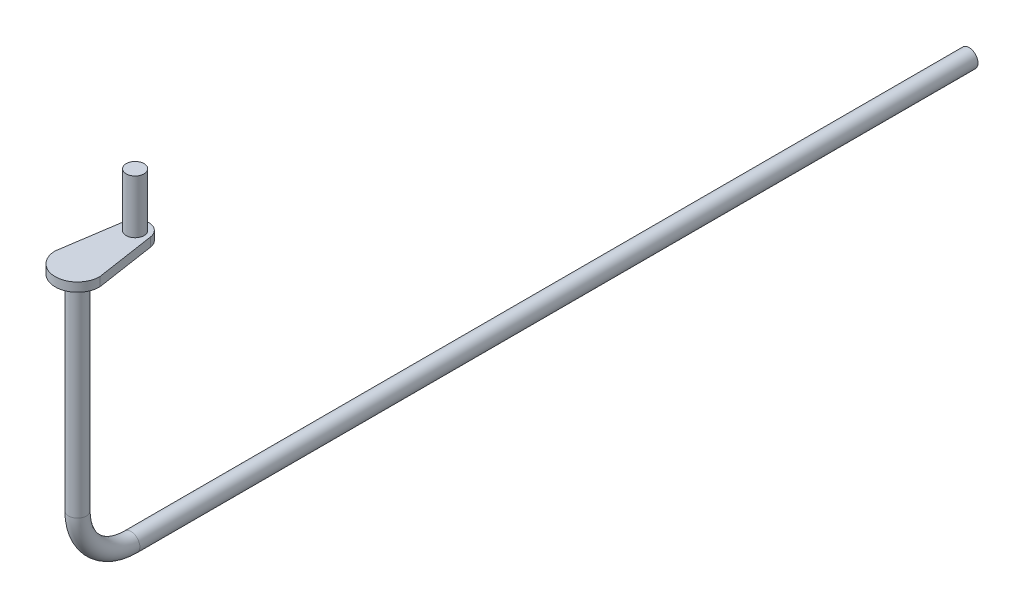
ISO-10303-21;
HEADER;
FILE_DESCRIPTION(('STEP AP214'),'2;1');
FILE_NAME('part.step','',(''),(''),'','','');
FILE_SCHEMA(('AUTOMOTIVE_DESIGN { 1 0 10303 214 1 1 1 1 }'));
ENDSEC;
DATA;
#1=APPLICATION_CONTEXT('core data for automotive mechanical design processes');
#2=APPLICATION_PROTOCOL_DEFINITION('international standard','automotive_design',2000,#1);
#3=PRODUCT_CONTEXT('',#1,'mechanical');
#4=PRODUCT('Part','Part','',(#3));
#5=PRODUCT_RELATED_PRODUCT_CATEGORY('part','',(#4));
#6=PRODUCT_DEFINITION_FORMATION('','',#4);
#7=PRODUCT_DEFINITION_CONTEXT('part definition',#1,'design');
#8=PRODUCT_DEFINITION('design','',#6,#7);
#9=PRODUCT_DEFINITION_SHAPE('','',#8);
#10=(LENGTH_UNIT() NAMED_UNIT(*) SI_UNIT(.MILLI.,.METRE.));
#11=(NAMED_UNIT(*) PLANE_ANGLE_UNIT() SI_UNIT($,.RADIAN.));
#12=(NAMED_UNIT(*) SI_UNIT($,.STERADIAN.) SOLID_ANGLE_UNIT());
#13=UNCERTAINTY_MEASURE_WITH_UNIT(LENGTH_MEASURE(1.E-05),#10,'distance_accuracy_value','');
#14=(GEOMETRIC_REPRESENTATION_CONTEXT(3) GLOBAL_UNCERTAINTY_ASSIGNED_CONTEXT((#13)) GLOBAL_UNIT_ASSIGNED_CONTEXT((#10,
#11,#12)) REPRESENTATION_CONTEXT('',''));
#15=CARTESIAN_POINT('',(0.,0.,0.));
#16=DIRECTION('',(0.,0.,1.));
#17=DIRECTION('',(1.,0.,0.));
#18=AXIS2_PLACEMENT_3D('',#15,#16,#17);
#19=CARTESIAN_POINT('',(24.4410760298696,10.,-3.69603885922141));
#20=DIRECTION('',(0.988758333059592,0.,-0.14952243579215));
#21=DIRECTION('',(-0.14952243579215,0.,-0.988758333059592));
#22=AXIS2_PLACEMENT_3D('',#19,#20,#21);
#23=PLANE('',#22);
#24=DIRECTION('',(0.149522435792151,0.,0.988758333059592));
#25=VECTOR('',#24,1.);
#26=CARTESIAN_POINT('',(24.4410760298696,0.,-3.69603885922141));
#27=LINE('',#26,#25);
#28=CARTESIAN_POINT('',(14.8313749958939,0.,-67.2428365368823));
#29=VERTEX_POINT('',#28);
#30=CARTESIAN_POINT('',(25.,0.,0.));
#31=VERTEX_POINT('',#30);
#32=EDGE_CURVE('E107',#29,#31,#27,.T.);
#33=ORIENTED_EDGE('',*,*,#32,.F.);
#34=DIRECTION('',(0.,-1.,0.));
#35=VECTOR('',#34,1.);
#36=CARTESIAN_POINT('',(14.8313749958939,10.,-67.2428365368823));
#37=LINE('',#36,#35);
#38=CARTESIAN_POINT('',(14.8313749958939,10.,-67.2428365368823));
#39=VERTEX_POINT('',#38);
#40=EDGE_CURVE('E12',#39,#29,#37,.T.);
#41=ORIENTED_EDGE('',*,*,#40,.F.);
#42=DIRECTION('',(0.149522435792151,0.,0.988758333059592));
#43=VECTOR('',#42,1.);
#44=CARTESIAN_POINT('',(24.4410760298696,10.,-3.69603885922141));
#45=LINE('',#44,#43);
#46=CARTESIAN_POINT('',(25.,10.,0.));
#47=VERTEX_POINT('',#46);
#48=EDGE_CURVE('E110',#39,#47,#45,.T.);
#49=ORIENTED_EDGE('',*,*,#48,.T.);
#50=DIRECTION('',(0.,-1.,0.));
#51=VECTOR('',#50,1.);
#52=CARTESIAN_POINT('',(25.,10.,0.));
#53=LINE('',#52,#51);
#54=EDGE_CURVE('E80',#47,#31,#53,.T.);
#55=ORIENTED_EDGE('',*,*,#54,.T.);
#56=EDGE_LOOP('',(#33,#41,#49,#55));
#57=FACE_BOUND('',#56,.T.);
#58=ADVANCED_FACE('F41',(#57),#23,.T.);
#59=CARTESIAN_POINT('',(0.,10.,-65.));
#60=DIRECTION('',(0.,-1.,0.));
#61=DIRECTION('',(0.,0.,-1.));
#62=AXIS2_PLACEMENT_3D('',#59,#60,#61);
#63=CYLINDRICAL_SURFACE('',#62,15.);
#64=CARTESIAN_POINT('',(0.,0.,-65.));
#65=DIRECTION('',(0.,1.,0.));
#66=DIRECTION('',(0.,0.,1.));
#67=AXIS2_PLACEMENT_3D('',#64,#65,#66);
#68=CIRCLE('',#67,15.);
#69=CARTESIAN_POINT('',(-14.8313749958939,0.,-67.2428365368823));
#70=VERTEX_POINT('',#69);
#71=EDGE_CURVE('E119',#29,#70,#68,.T.);
#72=ORIENTED_EDGE('',*,*,#71,.T.);
#73=DIRECTION('',(0.,-1.,0.));
#74=VECTOR('',#73,1.);
#75=CARTESIAN_POINT('',(-14.8313749958939,10.,-67.2428365368823));
#76=LINE('',#75,#74);
#77=CARTESIAN_POINT('',(-14.8313749958939,10.,-67.2428365368823));
#78=VERTEX_POINT('',#77);
#79=EDGE_CURVE('E49',#78,#70,#76,.T.);
#80=ORIENTED_EDGE('',*,*,#79,.F.);
#81=CARTESIAN_POINT('',(0.,10.,-65.));
#82=DIRECTION('',(0.,1.,0.));
#83=DIRECTION('',(0.,0.,1.));
#84=AXIS2_PLACEMENT_3D('',#81,#82,#83);
#85=CIRCLE('',#84,15.);
#86=EDGE_CURVE('E112',#39,#78,#85,.T.);
#87=ORIENTED_EDGE('',*,*,#86,.F.);
#88=ORIENTED_EDGE('',*,*,#40,.T.);
#89=EDGE_LOOP('',(#72,#80,#87,#88));
#90=FACE_BOUND('',#89,.T.);
#91=ADVANCED_FACE('F135',(#90),#63,.T.);
#92=CARTESIAN_POINT('',(-24.4410760298696,10.,-3.69603885922142));
#93=DIRECTION('',(0.988758333059592,0.,0.149522435792151));
#94=DIRECTION('',(0.149522435792151,0.,-0.988758333059592));
#95=AXIS2_PLACEMENT_3D('',#92,#93,#94);
#96=PLANE('',#95);
#97=DIRECTION('',(-0.149522435792151,0.,0.988758333059592));
#98=VECTOR('',#97,1.);
#99=CARTESIAN_POINT('',(-24.4410760298696,0.,-3.69603885922142));
#100=LINE('',#99,#98);
#101=CARTESIAN_POINT('',(-25.,0.,0.));
#102=VERTEX_POINT('',#101);
#103=EDGE_CURVE('E122',#70,#102,#100,.T.);
#104=ORIENTED_EDGE('',*,*,#103,.T.);
#105=DIRECTION('',(0.,-1.,0.));
#106=VECTOR('',#105,1.);
#107=CARTESIAN_POINT('',(-25.,10.,0.));
#108=LINE('',#107,#106);
#109=CARTESIAN_POINT('',(-25.,10.,0.));
#110=VERTEX_POINT('',#109);
#111=EDGE_CURVE('E127',#110,#102,#108,.T.);
#112=ORIENTED_EDGE('',*,*,#111,.F.);
#113=DIRECTION('',(-0.149522435792151,0.,0.988758333059592));
#114=VECTOR('',#113,1.);
#115=CARTESIAN_POINT('',(-24.4410760298696,10.,-3.69603885922142));
#116=LINE('',#115,#114);
#117=EDGE_CURVE('E115',#78,#110,#116,.T.);
#118=ORIENTED_EDGE('',*,*,#117,.F.);
#119=ORIENTED_EDGE('',*,*,#79,.T.);
#120=EDGE_LOOP('',(#104,#112,#118,#119));
#121=FACE_BOUND('',#120,.T.);
#122=ADVANCED_FACE('F131',(#121),#96,.F.);
#123=CARTESIAN_POINT('',(0.,10.,0.));
#124=DIRECTION('',(0.,-1.,0.));
#125=DIRECTION('',(0.,0.,-1.));
#126=AXIS2_PLACEMENT_3D('',#123,#124,#125);
#127=CYLINDRICAL_SURFACE('',#126,25.);
#128=CARTESIAN_POINT('',(0.,0.,0.));
#129=DIRECTION('',(0.,1.,0.));
#130=DIRECTION('',(0.,0.,1.));
#131=AXIS2_PLACEMENT_3D('',#128,#129,#130);
#132=CIRCLE('',#131,25.);
#133=EDGE_CURVE('E73',#102,#31,#132,.T.);
#134=ORIENTED_EDGE('',*,*,#133,.T.);
#135=ORIENTED_EDGE('',*,*,#54,.F.);
#136=CARTESIAN_POINT('',(0.,10.,0.));
#137=DIRECTION('',(0.,1.,0.));
#138=DIRECTION('',(0.,0.,1.));
#139=AXIS2_PLACEMENT_3D('',#136,#137,#138);
#140=CIRCLE('',#139,25.);
#141=EDGE_CURVE('E57',#110,#47,#140,.T.);
#142=ORIENTED_EDGE('',*,*,#141,.F.);
#143=ORIENTED_EDGE('',*,*,#111,.T.);
#144=EDGE_LOOP('',(#134,#135,#142,#143));
#145=FACE_BOUND('',#144,.T.);
#146=ADVANCED_FACE('F144',(#145),#127,.T.);
#147=CARTESIAN_POINT('',(0.,10.,0.));
#148=DIRECTION('',(0.,1.,0.));
#149=DIRECTION('',(0.,0.,1.));
#150=AXIS2_PLACEMENT_3D('',#147,#148,#149);
#151=PLANE('',#150);
#152=CARTESIAN_POINT('',(0.,10.,-64.677844524585));
#153=DIRECTION('',(0.,1.,0.));
#154=DIRECTION('',(0.,0.,1.));
#155=AXIS2_PLACEMENT_3D('',#152,#153,#154);
#156=CIRCLE('',#155,10.);
#157=CARTESIAN_POINT('',(0.,10.,-54.677844524585));
#158=VERTEX_POINT('',#157);
#159=EDGE_CURVE('E97',#158,#158,#156,.T.);
#160=ORIENTED_EDGE('',*,*,#159,.F.);
#161=EDGE_LOOP('',(#160));
#162=FACE_BOUND('',#161,.T.);
#163=ORIENTED_EDGE('',*,*,#48,.F.);
#164=ORIENTED_EDGE('',*,*,#86,.T.);
#165=ORIENTED_EDGE('',*,*,#117,.T.);
#166=ORIENTED_EDGE('',*,*,#141,.T.);
#167=EDGE_LOOP('',(#163,#164,#165,#166));
#168=FACE_BOUND('',#167,.T.);
#169=ADVANCED_FACE('F149',(#162,#168),#151,.T.);
#170=CARTESIAN_POINT('',(0.,0.,0.));
#171=DIRECTION('',(0.,1.,0.));
#172=DIRECTION('',(0.,0.,1.));
#173=AXIS2_PLACEMENT_3D('',#170,#171,#172);
#174=PLANE('',#173);
#175=CARTESIAN_POINT('',(0.,0.,0.));
#176=DIRECTION('',(0.,1.,0.));
#177=DIRECTION('',(0.,0.,1.));
#178=AXIS2_PLACEMENT_3D('',#175,#176,#177);
#179=CIRCLE('',#178,10.);
#180=CARTESIAN_POINT('',(0.,0.,10.));
#181=VERTEX_POINT('',#180);
#182=EDGE_CURVE('E93',#181,#181,#179,.F.);
#183=ORIENTED_EDGE('',*,*,#182,.F.);
#184=EDGE_LOOP('',(#183));
#185=FACE_BOUND('',#184,.T.);
#186=ORIENTED_EDGE('',*,*,#32,.T.);
#187=ORIENTED_EDGE('',*,*,#133,.F.);
#188=ORIENTED_EDGE('',*,*,#103,.F.);
#189=ORIENTED_EDGE('',*,*,#71,.F.);
#190=EDGE_LOOP('',(#186,#187,#188,#189));
#191=FACE_BOUND('',#190,.T.);
#192=ADVANCED_FACE('F136',(#185,#191),#174,.F.);
#193=CARTESIAN_POINT('',(0.,70.,-64.677844524585));
#194=DIRECTION('',(0.,-1.,0.));
#195=DIRECTION('',(0.,0.,-1.));
#196=AXIS2_PLACEMENT_3D('',#193,#194,#195);
#197=CYLINDRICAL_SURFACE('',#196,10.);
#198=CARTESIAN_POINT('',(0.,70.,-64.677844524585));
#199=DIRECTION('',(0.,1.,0.));
#200=DIRECTION('',(0.,0.,1.));
#201=AXIS2_PLACEMENT_3D('',#198,#199,#200);
#202=CIRCLE('',#201,10.);
#203=CARTESIAN_POINT('',(0.,70.,-54.677844524585));
#204=VERTEX_POINT('',#203);
#205=EDGE_CURVE('E104',#204,#204,#202,.T.);
#206=ORIENTED_EDGE('',*,*,#205,.F.);
#207=EDGE_LOOP('',(#206));
#208=FACE_BOUND('',#207,.T.);
#209=ORIENTED_EDGE('',*,*,#159,.T.);
#210=EDGE_LOOP('',(#209));
#211=FACE_BOUND('',#210,.T.);
#212=ADVANCED_FACE('F153',(#208,#211),#197,.T.);
#213=CARTESIAN_POINT('',(0.,70.,-64.677844524585));
#214=DIRECTION('',(0.,1.,0.));
#215=DIRECTION('',(0.,0.,1.));
#216=AXIS2_PLACEMENT_3D('',#213,#214,#215);
#217=PLANE('',#216);
#218=ORIENTED_EDGE('',*,*,#205,.T.);
#219=EDGE_LOOP('',(#218));
#220=FACE_BOUND('',#219,.T.);
#221=ADVANCED_FACE('F160',(#220),#217,.T.);
#222=CARTESIAN_POINT('',(0.,-290.,-60.0000000000004));
#223=DIRECTION('',(0.,0.,-1.));
#224=DIRECTION('',(-1.,0.,0.));
#225=AXIS2_PLACEMENT_3D('',#222,#223,#224);
#226=CYLINDRICAL_SURFACE('',#225,10.);
#227=CARTESIAN_POINT('',(0.,-290.,-1000.));
#228=DIRECTION('',(0.,0.,1.));
#229=DIRECTION('',(0.,-1.,0.));
#230=AXIS2_PLACEMENT_3D('',#227,#228,#229);
#231=CIRCLE('',#230,10.);
#232=CARTESIAN_POINT('',(0.,-300.,-1000.));
#233=VERTEX_POINT('',#232);
#234=EDGE_CURVE('E89',#233,#233,#231,.T.);
#235=ORIENTED_EDGE('',*,*,#234,.T.);
#236=EDGE_LOOP('',(#235));
#237=FACE_BOUND('',#236,.T.);
#238=CARTESIAN_POINT('',(0.,-290.,-60.0000000000004));
#239=DIRECTION('',(0.,0.,1.));
#240=DIRECTION('',(0.,-1.,0.));
#241=AXIS2_PLACEMENT_3D('',#238,#239,#240);
#242=CIRCLE('',#241,10.);
#243=CARTESIAN_POINT('',(0.,-300.,-60.0000000000005));
#244=VERTEX_POINT('',#243);
#245=EDGE_CURVE('E94',#244,#244,#242,.T.);
#246=ORIENTED_EDGE('',*,*,#245,.F.);
#247=EDGE_LOOP('',(#246));
#248=FACE_BOUND('',#247,.T.);
#249=ADVANCED_FACE('F90',(#237,#248),#226,.T.);
#250=CARTESIAN_POINT('',(0.,-230.,-60.));
#251=DIRECTION('',(1.,0.,0.));
#252=DIRECTION('',(0.,0.,-1.));
#253=AXIS2_PLACEMENT_3D('',#250,#251,#252);
#254=TOROIDAL_SURFACE('',#253,60.0000000000001,10.);
#255=CARTESIAN_POINT('',(0.,-230.,0.));
#256=DIRECTION('',(0.,1.,0.));
#257=DIRECTION('',(0.,0.,1.));
#258=AXIS2_PLACEMENT_3D('',#255,#256,#257);
#259=CIRCLE('',#258,10.);
#260=CARTESIAN_POINT('',(0.,-229.999999999999,10.));
#261=VERTEX_POINT('',#260);
#262=EDGE_CURVE('E100',#261,#261,#259,.T.);
#263=CARTESIAN_POINT('',(0.,-230.,-60.));
#264=DIRECTION('',(1.,0.,0.));
#265=DIRECTION('',(0.,0.,-1.));
#266=AXIS2_PLACEMENT_3D('',#263,#264,#265);
#267=CIRCLE('',#266,70.0000000000001);
#268=EDGE_CURVE('',#261,#244,#267,.T.);
#269=ORIENTED_EDGE('',*,*,#262,.F.);
#270=ORIENTED_EDGE('',*,*,#245,.T.);
#271=ORIENTED_EDGE('',*,*,#268,.T.);
#272=ORIENTED_EDGE('',*,*,#268,.F.);
#273=EDGE_LOOP('',(#269,#271,#270,#272));
#274=FACE_BOUND('',#273,.T.);
#275=ADVANCED_FACE('F169',(#274),#254,.T.);
#276=CARTESIAN_POINT('',(0.,-290.,-1000.));
#277=DIRECTION('',(0.,0.,1.));
#278=DIRECTION('',(0.,-1.,0.));
#279=AXIS2_PLACEMENT_3D('',#276,#277,#278);
#280=PLANE('',#279);
#281=ORIENTED_EDGE('',*,*,#234,.F.);
#282=EDGE_LOOP('',(#281));
#283=FACE_BOUND('',#282,.T.);
#284=ADVANCED_FACE('F165',(#283),#280,.F.);
#285=CARTESIAN_POINT('',(0.,10.,0.));
#286=DIRECTION('',(0.,-1.,0.));
#287=DIRECTION('',(0.,0.,-1.));
#288=AXIS2_PLACEMENT_3D('',#285,#286,#287);
#289=CYLINDRICAL_SURFACE('',#288,10.);
#290=ORIENTED_EDGE('',*,*,#262,.T.);
#291=EDGE_LOOP('',(#290));
#292=FACE_BOUND('',#291,.T.);
#293=ORIENTED_EDGE('',*,*,#182,.T.);
#294=EDGE_LOOP('',(#293));
#295=FACE_BOUND('',#294,.T.);
#296=ADVANCED_FACE('F168',(#292,#295),#289,.T.);
#297=CLOSED_SHELL('',(#58,#91,#122,#146,#169,#192,#212,#221,#249,#275,#284,#296));
#298=MANIFOLD_SOLID_BREP('B2',#297);
#299=ADVANCED_BREP_SHAPE_REPRESENTATION('',(#18,#298),#14);
#300=SHAPE_DEFINITION_REPRESENTATION(#9,#299);
ENDSEC;
END-ISO-10303-21;
